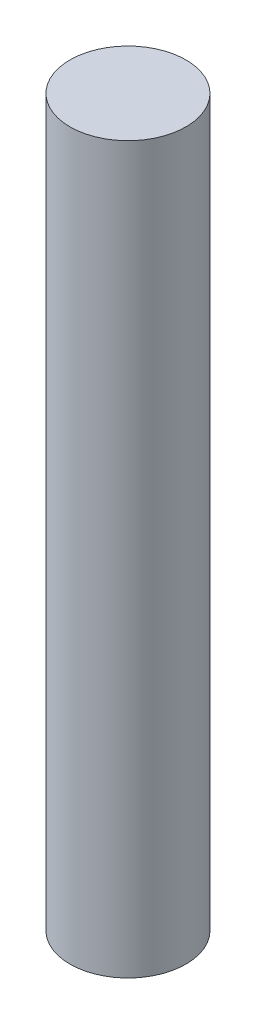
ISO-10303-21;
HEADER;
FILE_DESCRIPTION(('STEP AP214'),'2;1');
FILE_NAME('part.step','',(''),(''),'','','');
FILE_SCHEMA(('AUTOMOTIVE_DESIGN { 1 0 10303 214 1 1 1 1 }'));
ENDSEC;
DATA;
#1=APPLICATION_CONTEXT('core data for automotive mechanical design processes');
#2=APPLICATION_PROTOCOL_DEFINITION('international standard','automotive_design',2000,#1);
#3=PRODUCT_CONTEXT('',#1,'mechanical');
#4=PRODUCT('Part','Part','',(#3));
#5=PRODUCT_RELATED_PRODUCT_CATEGORY('part','',(#4));
#6=PRODUCT_DEFINITION_FORMATION('','',#4);
#7=PRODUCT_DEFINITION_CONTEXT('part definition',#1,'design');
#8=PRODUCT_DEFINITION('design','',#6,#7);
#9=PRODUCT_DEFINITION_SHAPE('','',#8);
#10=(LENGTH_UNIT() NAMED_UNIT(*) SI_UNIT(.MILLI.,.METRE.));
#11=(NAMED_UNIT(*) PLANE_ANGLE_UNIT() SI_UNIT($,.RADIAN.));
#12=(NAMED_UNIT(*) SI_UNIT($,.STERADIAN.) SOLID_ANGLE_UNIT());
#13=UNCERTAINTY_MEASURE_WITH_UNIT(LENGTH_MEASURE(1.E-05),#10,'distance_accuracy_value','');
#14=(GEOMETRIC_REPRESENTATION_CONTEXT(3) GLOBAL_UNCERTAINTY_ASSIGNED_CONTEXT((#13)) GLOBAL_UNIT_ASSIGNED_CONTEXT((#10,
#11,#12)) REPRESENTATION_CONTEXT('',''));
#15=CARTESIAN_POINT('',(0.,0.,0.));
#16=DIRECTION('',(0.,0.,1.));
#17=DIRECTION('',(1.,0.,0.));
#18=AXIS2_PLACEMENT_3D('',#15,#16,#17);
#19=CARTESIAN_POINT('',(0.,38.1,0.));
#20=DIRECTION('',(0.,-1.,0.));
#21=DIRECTION('',(0.,0.,-1.));
#22=AXIS2_PLACEMENT_3D('',#19,#20,#21);
#23=CYLINDRICAL_SURFACE('',#22,3.048);
#24=CARTESIAN_POINT('',(0.,38.1,0.));
#25=DIRECTION('',(0.,1.,0.));
#26=DIRECTION('',(0.,0.,1.));
#27=AXIS2_PLACEMENT_3D('',#24,#25,#26);
#28=CIRCLE('',#27,3.048);
#29=CARTESIAN_POINT('',(0.,38.1,3.048));
#30=VERTEX_POINT('',#29);
#31=EDGE_CURVE('E10',#30,#30,#28,.T.);
#32=ORIENTED_EDGE('',*,*,#31,.F.);
#33=EDGE_LOOP('',(#32));
#34=FACE_BOUND('',#33,.T.);
#35=CARTESIAN_POINT('',(0.,0.,0.));
#36=DIRECTION('',(0.,1.,0.));
#37=DIRECTION('',(0.,0.,1.));
#38=AXIS2_PLACEMENT_3D('',#35,#36,#37);
#39=CIRCLE('',#38,3.048);
#40=CARTESIAN_POINT('',(0.,0.,3.048));
#41=VERTEX_POINT('',#40);
#42=EDGE_CURVE('E44',#41,#41,#39,.T.);
#43=ORIENTED_EDGE('',*,*,#42,.T.);
#44=EDGE_LOOP('',(#43));
#45=FACE_BOUND('',#44,.T.);
#46=ADVANCED_FACE('F41',(#34,#45),#23,.T.);
#47=CARTESIAN_POINT('',(0.,38.1,0.));
#48=DIRECTION('',(0.,1.,0.));
#49=DIRECTION('',(0.,0.,1.));
#50=AXIS2_PLACEMENT_3D('',#47,#48,#49);
#51=PLANE('',#50);
#52=ORIENTED_EDGE('',*,*,#31,.T.);
#53=EDGE_LOOP('',(#52));
#54=FACE_BOUND('',#53,.T.);
#55=ADVANCED_FACE('F58',(#54),#51,.T.);
#56=CARTESIAN_POINT('',(0.,0.,0.));
#57=DIRECTION('',(0.,1.,0.));
#58=DIRECTION('',(0.,0.,1.));
#59=AXIS2_PLACEMENT_3D('',#56,#57,#58);
#60=PLANE('',#59);
#61=ORIENTED_EDGE('',*,*,#42,.F.);
#62=EDGE_LOOP('',(#61));
#63=FACE_BOUND('',#62,.T.);
#64=ADVANCED_FACE('F56',(#63),#60,.F.);
#65=CLOSED_SHELL('',(#46,#55,#64));
#66=MANIFOLD_SOLID_BREP('B2',#65);
#67=ADVANCED_BREP_SHAPE_REPRESENTATION('',(#18,#66),#14);
#68=SHAPE_DEFINITION_REPRESENTATION(#9,#67);
ENDSEC;
END-ISO-10303-21;
